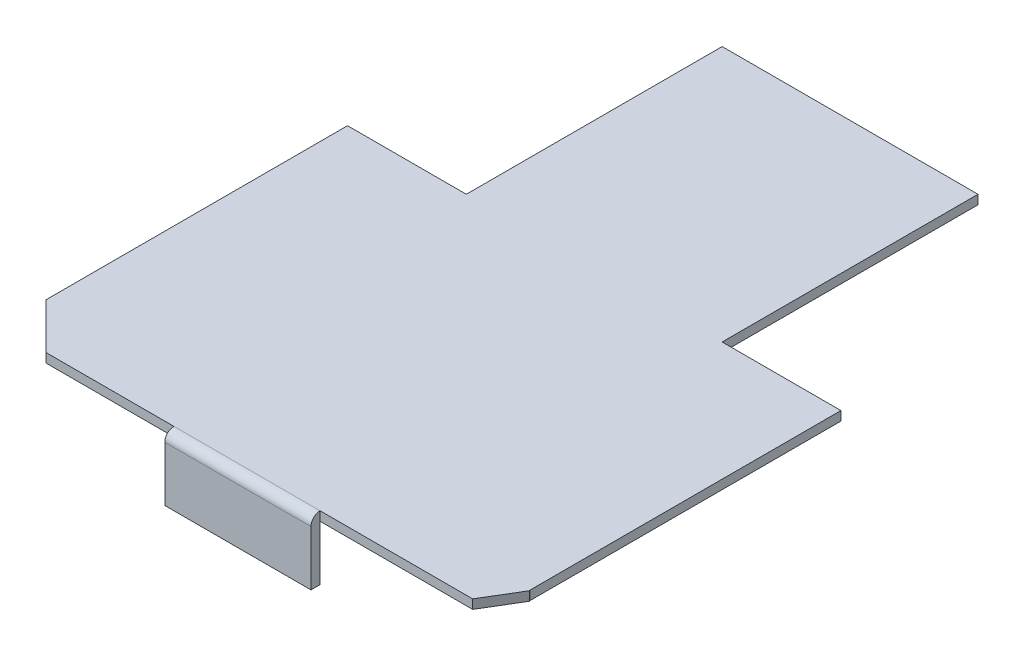
ISO-10303-21;
HEADER;
FILE_DESCRIPTION(('STEP AP214'),'2;1');
FILE_NAME('part.step','',(''),(''),'','','');
FILE_SCHEMA(('AUTOMOTIVE_DESIGN { 1 0 10303 214 1 1 1 1 }'));
ENDSEC;
DATA;
#1=APPLICATION_CONTEXT('core data for automotive mechanical design processes');
#2=APPLICATION_PROTOCOL_DEFINITION('international standard','automotive_design',2000,#1);
#3=PRODUCT_CONTEXT('',#1,'mechanical');
#4=PRODUCT('Part','Part','',(#3));
#5=PRODUCT_RELATED_PRODUCT_CATEGORY('part','',(#4));
#6=PRODUCT_DEFINITION_FORMATION('','',#4);
#7=PRODUCT_DEFINITION_CONTEXT('part definition',#1,'design');
#8=PRODUCT_DEFINITION('design','',#6,#7);
#9=PRODUCT_DEFINITION_SHAPE('','',#8);
#10=(LENGTH_UNIT() NAMED_UNIT(*) SI_UNIT(.MILLI.,.METRE.));
#11=(NAMED_UNIT(*) PLANE_ANGLE_UNIT() SI_UNIT($,.RADIAN.));
#12=(NAMED_UNIT(*) SI_UNIT($,.STERADIAN.) SOLID_ANGLE_UNIT());
#13=UNCERTAINTY_MEASURE_WITH_UNIT(LENGTH_MEASURE(1.E-05),#10,'distance_accuracy_value','');
#14=(GEOMETRIC_REPRESENTATION_CONTEXT(3) GLOBAL_UNCERTAINTY_ASSIGNED_CONTEXT((#13)) GLOBAL_UNIT_ASSIGNED_CONTEXT((#10,
#11,#12)) REPRESENTATION_CONTEXT('',''));
#15=CARTESIAN_POINT('',(0.,0.,0.));
#16=DIRECTION('',(0.,0.,1.));
#17=DIRECTION('',(1.,0.,0.));
#18=AXIS2_PLACEMENT_3D('',#15,#16,#17);
#19=CARTESIAN_POINT('',(-25.4,-19.05,66.675));
#20=DIRECTION('',(1.,0.,0.));
#21=DIRECTION('',(0.,0.,-1.));
#22=AXIS2_PLACEMENT_3D('',#19,#20,#21);
#23=PLANE('',#22);
#24=DIRECTION('',(0.,1.,0.));
#25=VECTOR('',#24,1.);
#26=CARTESIAN_POINT('',(-25.4,-19.05,69.85));
#27=LINE('',#26,#25);
#28=CARTESIAN_POINT('',(-25.4,-19.05,69.85));
#29=VERTEX_POINT('',#28);
#30=CARTESIAN_POINT('',(-25.4,0.,69.8500000000001));
#31=VERTEX_POINT('',#30);
#32=EDGE_CURVE('E268',#29,#31,#27,.T.);
#33=ORIENTED_EDGE('',*,*,#32,.T.);
#34=CARTESIAN_POINT('',(-25.4,0.,66.6750000000001));
#35=DIRECTION('',(1.,0.,0.));
#36=DIRECTION('',(0.,0.,1.));
#37=AXIS2_PLACEMENT_3D('',#34,#35,#36);
#38=CIRCLE('',#37,3.17499999999996);
#39=CARTESIAN_POINT('',(-25.4,3.175,66.675));
#40=VERTEX_POINT('',#39);
#41=EDGE_CURVE('E227',#40,#31,#38,.T.);
#42=ORIENTED_EDGE('',*,*,#41,.F.);
#43=DIRECTION('',(0.,1.,0.));
#44=VECTOR('',#43,1.);
#45=CARTESIAN_POINT('',(-25.4,-19.05,66.675));
#46=LINE('',#45,#44);
#47=CARTESIAN_POINT('',(-25.4,0.,66.675));
#48=VERTEX_POINT('',#47);
#49=EDGE_CURVE('E246',#48,#40,#46,.T.);
#50=ORIENTED_EDGE('',*,*,#49,.F.);
#51=CARTESIAN_POINT('',(-25.4,-19.05,66.675));
#52=VERTEX_POINT('',#51);
#53=EDGE_CURVE('E41',#52,#48,#46,.T.);
#54=ORIENTED_EDGE('',*,*,#53,.F.);
#55=DIRECTION('',(0.,0.,-1.));
#56=VECTOR('',#55,1.);
#57=CARTESIAN_POINT('',(-25.4,-19.05,66.675));
#58=LINE('',#57,#56);
#59=EDGE_CURVE('E260',#29,#52,#58,.T.);
#60=ORIENTED_EDGE('',*,*,#59,.F.);
#61=EDGE_LOOP('',(#33,#42,#50,#54,#60));
#62=FACE_BOUND('',#61,.T.);
#63=ADVANCED_FACE('F33',(#62),#23,.F.);
#64=CARTESIAN_POINT('',(-25.4,-19.05,66.675));
#65=DIRECTION('',(0.,0.,1.));
#66=DIRECTION('',(1.,0.,0.));
#67=AXIS2_PLACEMENT_3D('',#64,#65,#66);
#68=PLANE('',#67);
#69=ORIENTED_EDGE('',*,*,#53,.T.);
#70=DIRECTION('',(1.,0.,0.));
#71=VECTOR('',#70,1.);
#72=CARTESIAN_POINT('',(-82.55,0.,66.675));
#73=LINE('',#72,#71);
#74=CARTESIAN_POINT('',(25.4,0.,66.675));
#75=VERTEX_POINT('',#74);
#76=EDGE_CURVE('E11',#48,#75,#73,.T.);
#77=ORIENTED_EDGE('',*,*,#76,.T.);
#78=DIRECTION('',(0.,1.,0.));
#79=VECTOR('',#78,1.);
#80=CARTESIAN_POINT('',(25.4,-19.05,66.675));
#81=LINE('',#80,#79);
#82=CARTESIAN_POINT('',(25.4,-19.05,66.675));
#83=VERTEX_POINT('',#82);
#84=EDGE_CURVE('E239',#83,#75,#81,.T.);
#85=ORIENTED_EDGE('',*,*,#84,.F.);
#86=DIRECTION('',(1.,0.,0.));
#87=VECTOR('',#86,1.);
#88=CARTESIAN_POINT('',(-25.4,-19.05,66.675));
#89=LINE('',#88,#87);
#90=EDGE_CURVE('E264',#52,#83,#89,.T.);
#91=ORIENTED_EDGE('',*,*,#90,.F.);
#92=EDGE_LOOP('',(#69,#77,#85,#91));
#93=FACE_BOUND('',#92,.T.);
#94=ADVANCED_FACE('F350',(#93),#68,.F.);
#95=CARTESIAN_POINT('',(25.4,-19.05,66.675));
#96=DIRECTION('',(-1.,0.,0.));
#97=DIRECTION('',(0.,0.,1.));
#98=AXIS2_PLACEMENT_3D('',#95,#96,#97);
#99=PLANE('',#98);
#100=ORIENTED_EDGE('',*,*,#84,.T.);
#101=CARTESIAN_POINT('',(25.4,3.175,66.675));
#102=VERTEX_POINT('',#101);
#103=EDGE_CURVE('E236',#75,#102,#81,.T.);
#104=ORIENTED_EDGE('',*,*,#103,.T.);
#105=CARTESIAN_POINT('',(25.4,0.,66.675));
#106=DIRECTION('',(1.,0.,0.));
#107=DIRECTION('',(0.,0.,1.));
#108=AXIS2_PLACEMENT_3D('',#105,#106,#107);
#109=CIRCLE('',#108,3.17499999999996);
#110=CARTESIAN_POINT('',(25.4,0.,69.85));
#111=VERTEX_POINT('',#110);
#112=EDGE_CURVE('E221',#102,#111,#109,.T.);
#113=ORIENTED_EDGE('',*,*,#112,.T.);
#114=DIRECTION('',(0.,1.,0.));
#115=VECTOR('',#114,1.);
#116=CARTESIAN_POINT('',(25.4,-19.05,69.85));
#117=LINE('',#116,#115);
#118=CARTESIAN_POINT('',(25.4,-19.05,69.85));
#119=VERTEX_POINT('',#118);
#120=EDGE_CURVE('E240',#119,#111,#117,.T.);
#121=ORIENTED_EDGE('',*,*,#120,.F.);
#122=DIRECTION('',(0.,0.,1.));
#123=VECTOR('',#122,1.);
#124=CARTESIAN_POINT('',(25.4,-19.05,66.675));
#125=LINE('',#124,#123);
#126=EDGE_CURVE('E272',#83,#119,#125,.T.);
#127=ORIENTED_EDGE('',*,*,#126,.F.);
#128=EDGE_LOOP('',(#100,#104,#113,#121,#127));
#129=FACE_BOUND('',#128,.T.);
#130=ADVANCED_FACE('F363',(#129),#99,.F.);
#131=CARTESIAN_POINT('',(-25.4,-19.05,69.85));
#132=DIRECTION('',(0.,0.,-1.));
#133=DIRECTION('',(-1.,0.,0.));
#134=AXIS2_PLACEMENT_3D('',#131,#132,#133);
#135=PLANE('',#134);
#136=DIRECTION('',(-1.,0.,0.));
#137=VECTOR('',#136,1.);
#138=CARTESIAN_POINT('',(-25.4,0.,69.85));
#139=LINE('',#138,#137);
#140=EDGE_CURVE('E254',#111,#31,#139,.T.);
#141=ORIENTED_EDGE('',*,*,#140,.T.);
#142=ORIENTED_EDGE('',*,*,#32,.F.);
#143=DIRECTION('',(-1.,0.,0.));
#144=VECTOR('',#143,1.);
#145=CARTESIAN_POINT('',(-25.4,-19.05,69.85));
#146=LINE('',#145,#144);
#147=EDGE_CURVE('E58',#119,#29,#146,.T.);
#148=ORIENTED_EDGE('',*,*,#147,.F.);
#149=ORIENTED_EDGE('',*,*,#120,.T.);
#150=EDGE_LOOP('',(#141,#142,#148,#149));
#151=FACE_BOUND('',#150,.T.);
#152=ADVANCED_FACE('F355',(#151),#135,.F.);
#153=CARTESIAN_POINT('',(-25.4,-19.05,69.85));
#154=DIRECTION('',(0.,1.,0.));
#155=DIRECTION('',(0.,0.,1.));
#156=AXIS2_PLACEMENT_3D('',#153,#154,#155);
#157=PLANE('',#156);
#158=ORIENTED_EDGE('',*,*,#59,.T.);
#159=ORIENTED_EDGE('',*,*,#90,.T.);
#160=ORIENTED_EDGE('',*,*,#126,.T.);
#161=ORIENTED_EDGE('',*,*,#147,.T.);
#162=EDGE_LOOP('',(#158,#159,#160,#161));
#163=FACE_BOUND('',#162,.T.);
#164=ADVANCED_FACE('F352',(#163),#157,.F.);
#165=CARTESIAN_POINT('',(-25.4,0.,66.6750000000001));
#166=DIRECTION('',(1.,0.,0.));
#167=DIRECTION('',(0.,0.,-1.));
#168=AXIS2_PLACEMENT_3D('',#165,#166,#167);
#169=CYLINDRICAL_SURFACE('',#168,3.17499999999996);
#170=ORIENTED_EDGE('',*,*,#112,.F.);
#171=DIRECTION('',(1.,0.,0.));
#172=VECTOR('',#171,1.);
#173=CARTESIAN_POINT('',(-25.4,3.175,66.6750000000001));
#174=LINE('',#173,#172);
#175=EDGE_CURVE('E233',#40,#102,#174,.T.);
#176=ORIENTED_EDGE('',*,*,#175,.F.);
#177=ORIENTED_EDGE('',*,*,#41,.T.);
#178=ORIENTED_EDGE('',*,*,#140,.F.);
#179=EDGE_LOOP('',(#170,#176,#177,#178));
#180=FACE_BOUND('',#179,.T.);
#181=ADVANCED_FACE('F354',(#180),#169,.T.);
#182=CARTESIAN_POINT('',(-82.55,0.,66.675));
#183=DIRECTION('',(0.,0.,1.));
#184=DIRECTION('',(1.,0.,0.));
#185=AXIS2_PLACEMENT_3D('',#182,#183,#184);
#186=PLANE('',#185);
#187=ORIENTED_EDGE('',*,*,#103,.F.);
#188=CARTESIAN_POINT('',(78.4273117109311,0.,66.675));
#189=VERTEX_POINT('',#188);
#190=EDGE_CURVE('E44',#75,#189,#73,.T.);
#191=ORIENTED_EDGE('',*,*,#190,.T.);
#192=DIRECTION('',(0.,1.,0.));
#193=VECTOR('',#192,1.);
#194=CARTESIAN_POINT('',(78.4273117109312,0.,66.675));
#195=LINE('',#194,#193);
#196=CARTESIAN_POINT('',(78.4273117109311,3.175,66.675));
#197=VERTEX_POINT('',#196);
#198=EDGE_CURVE('E208',#189,#197,#195,.T.);
#199=ORIENTED_EDGE('',*,*,#198,.T.);
#200=DIRECTION('',(1.,0.,0.));
#201=VECTOR('',#200,1.);
#202=CARTESIAN_POINT('',(-82.55,3.175,66.675));
#203=LINE('',#202,#201);
#204=EDGE_CURVE('E276',#102,#197,#203,.T.);
#205=ORIENTED_EDGE('',*,*,#204,.F.);
#206=EDGE_LOOP('',(#187,#191,#199,#205));
#207=FACE_BOUND('',#206,.T.);
#208=ADVANCED_FACE('F340',(#207),#186,.T.);
#209=CARTESIAN_POINT('',(-85.725,3.175,-53.975));
#210=DIRECTION('',(0.,0.,1.));
#211=DIRECTION('',(1.,0.,0.));
#212=AXIS2_PLACEMENT_3D('',#209,#210,#211);
#213=PLANE('',#212);
#214=DIRECTION('',(0.,1.,0.));
#215=VECTOR('',#214,1.);
#216=CARTESIAN_POINT('',(-44.45,0.,-53.975));
#217=LINE('',#216,#215);
#218=CARTESIAN_POINT('',(-44.45,0.,-53.975));
#219=VERTEX_POINT('',#218);
#220=CARTESIAN_POINT('',(-44.45,3.175,-53.975));
#221=VERTEX_POINT('',#220);
#222=EDGE_CURVE('E152',#219,#221,#217,.T.);
#223=ORIENTED_EDGE('',*,*,#222,.F.);
#224=DIRECTION('',(-1.,0.,0.));
#225=VECTOR('',#224,1.);
#226=CARTESIAN_POINT('',(-85.725,0.,-53.975));
#227=LINE('',#226,#225);
#228=CARTESIAN_POINT('',(-85.725,0.,-53.975));
#229=VERTEX_POINT('',#228);
#230=EDGE_CURVE('E165',#219,#229,#227,.T.);
#231=ORIENTED_EDGE('',*,*,#230,.T.);
#232=DIRECTION('',(0.,-1.,0.));
#233=VECTOR('',#232,1.);
#234=CARTESIAN_POINT('',(-85.725,3.175,-53.975));
#235=LINE('',#234,#233);
#236=CARTESIAN_POINT('',(-85.725,3.175,-53.975));
#237=VERTEX_POINT('',#236);
#238=EDGE_CURVE('E199',#237,#229,#235,.T.);
#239=ORIENTED_EDGE('',*,*,#238,.F.);
#240=DIRECTION('',(-1.,0.,0.));
#241=VECTOR('',#240,1.);
#242=CARTESIAN_POINT('',(-85.725,3.175,-53.975));
#243=LINE('',#242,#241);
#244=EDGE_CURVE('E167',#221,#237,#243,.T.);
#245=ORIENTED_EDGE('',*,*,#244,.F.);
#246=EDGE_LOOP('',(#223,#231,#239,#245));
#247=FACE_BOUND('',#246,.T.);
#248=ADVANCED_FACE('F163',(#247),#213,.F.);
#249=CARTESIAN_POINT('',(85.725,3.175,53.975));
#250=DIRECTION('',(-1.,0.,0.));
#251=DIRECTION('',(0.,0.,1.));
#252=AXIS2_PLACEMENT_3D('',#249,#250,#251);
#253=PLANE('',#252);
#254=DIRECTION('',(0.,0.,-1.));
#255=VECTOR('',#254,1.);
#256=CARTESIAN_POINT('',(85.725,0.,53.975));
#257=LINE('',#256,#255);
#258=CARTESIAN_POINT('',(85.725,0.,53.975));
#259=VERTEX_POINT('',#258);
#260=CARTESIAN_POINT('',(85.725,0.,-53.975));
#261=VERTEX_POINT('',#260);
#262=EDGE_CURVE('E177',#259,#261,#257,.T.);
#263=ORIENTED_EDGE('',*,*,#262,.T.);
#264=DIRECTION('',(0.,-1.,0.));
#265=VECTOR('',#264,1.);
#266=CARTESIAN_POINT('',(85.725,3.175,-53.975));
#267=LINE('',#266,#265);
#268=CARTESIAN_POINT('',(85.725,3.175,-53.975));
#269=VERTEX_POINT('',#268);
#270=EDGE_CURVE('E202',#269,#261,#267,.T.);
#271=ORIENTED_EDGE('',*,*,#270,.F.);
#272=DIRECTION('',(0.,0.,-1.));
#273=VECTOR('',#272,1.);
#274=CARTESIAN_POINT('',(85.725,3.175,53.975));
#275=LINE('',#274,#273);
#276=CARTESIAN_POINT('',(85.725,3.175,53.975));
#277=VERTEX_POINT('',#276);
#278=EDGE_CURVE('E195',#277,#269,#275,.T.);
#279=ORIENTED_EDGE('',*,*,#278,.F.);
#280=DIRECTION('',(0.,-1.,0.));
#281=VECTOR('',#280,1.);
#282=CARTESIAN_POINT('',(85.725,3.175,53.975));
#283=LINE('',#282,#281);
#284=EDGE_CURVE('E196',#277,#259,#283,.T.);
#285=ORIENTED_EDGE('',*,*,#284,.T.);
#286=EDGE_LOOP('',(#263,#271,#279,#285));
#287=FACE_BOUND('',#286,.T.);
#288=ADVANCED_FACE('F330',(#287),#253,.F.);
#289=CARTESIAN_POINT('',(44.45,0.,-53.975));
#290=VERTEX_POINT('',#289);
#291=EDGE_CURVE('E176',#261,#290,#227,.T.);
#292=ORIENTED_EDGE('',*,*,#291,.T.);
#293=DIRECTION('',(0.,1.,0.));
#294=VECTOR('',#293,1.);
#295=CARTESIAN_POINT('',(44.45,0.,-53.975));
#296=LINE('',#295,#294);
#297=CARTESIAN_POINT('',(44.45,3.175,-53.975));
#298=VERTEX_POINT('',#297);
#299=EDGE_CURVE('E168',#290,#298,#296,.T.);
#300=ORIENTED_EDGE('',*,*,#299,.T.);
#301=EDGE_CURVE('E187',#269,#298,#243,.T.);
#302=ORIENTED_EDGE('',*,*,#301,.F.);
#303=ORIENTED_EDGE('',*,*,#270,.T.);
#304=EDGE_LOOP('',(#292,#300,#302,#303));
#305=FACE_BOUND('',#304,.T.);
#306=ADVANCED_FACE('F326',(#305),#213,.F.);
#307=CARTESIAN_POINT('',(-85.725,3.175,53.975));
#308=DIRECTION('',(1.,0.,0.));
#309=DIRECTION('',(0.,0.,-1.));
#310=AXIS2_PLACEMENT_3D('',#307,#308,#309);
#311=PLANE('',#310);
#312=DIRECTION('',(0.,0.,1.));
#313=VECTOR('',#312,1.);
#314=CARTESIAN_POINT('',(-85.725,0.,53.975));
#315=LINE('',#314,#313);
#316=CARTESIAN_POINT('',(-85.725,0.,50.7999999999998));
#317=VERTEX_POINT('',#316);
#318=EDGE_CURVE('E175',#229,#317,#315,.T.);
#319=ORIENTED_EDGE('',*,*,#318,.T.);
#320=DIRECTION('',(0.,-1.,0.));
#321=VECTOR('',#320,1.);
#322=CARTESIAN_POINT('',(-85.725,0.,50.7999999999997));
#323=LINE('',#322,#321);
#324=CARTESIAN_POINT('',(-85.725,3.175,50.7999999999998));
#325=VERTEX_POINT('',#324);
#326=EDGE_CURVE('E220',#317,#325,#323,.F.);
#327=ORIENTED_EDGE('',*,*,#326,.T.);
#328=DIRECTION('',(0.,0.,1.));
#329=VECTOR('',#328,1.);
#330=CARTESIAN_POINT('',(-85.725,3.175,53.975));
#331=LINE('',#330,#329);
#332=EDGE_CURVE('E200',#237,#325,#331,.T.);
#333=ORIENTED_EDGE('',*,*,#332,.F.);
#334=ORIENTED_EDGE('',*,*,#238,.T.);
#335=EDGE_LOOP('',(#319,#327,#333,#334));
#336=FACE_BOUND('',#335,.T.);
#337=ADVANCED_FACE('F420',(#336),#311,.F.);
#338=CARTESIAN_POINT('',(85.725,3.175,-53.975));
#339=DIRECTION('',(0.,-1.,0.));
#340=DIRECTION('',(0.,0.,-1.));
#341=AXIS2_PLACEMENT_3D('',#338,#339,#340);
#342=PLANE('',#341);
#343=CARTESIAN_POINT('',(-69.8499999999999,3.175,66.675));
#344=VERTEX_POINT('',#343);
#345=EDGE_CURVE('E279',#344,#40,#203,.T.);
#346=ORIENTED_EDGE('',*,*,#345,.T.);
#347=ORIENTED_EDGE('',*,*,#175,.T.);
#348=ORIENTED_EDGE('',*,*,#204,.T.);
#349=DIRECTION('',(-0.514495755427524,0.,0.857492925712546));
#350=VECTOR('',#349,1.);
#351=CARTESIAN_POINT('',(78.4273117109312,3.175,66.675));
#352=LINE('',#351,#350);
#353=CARTESIAN_POINT('',(85.8197975620386,3.175,54.3541902481542));
#354=VERTEX_POINT('',#353);
#355=EDGE_CURVE('E213',#197,#354,#352,.F.);
#356=ORIENTED_EDGE('',*,*,#355,.T.);
#357=DIRECTION('',(-0.242535625036332,0.,-0.970142500145332));
#358=VECTOR('',#357,1.);
#359=CARTESIAN_POINT('',(88.9,3.175,66.675));
#360=LINE('',#359,#358);
#361=EDGE_CURVE('E284',#354,#277,#360,.T.);
#362=ORIENTED_EDGE('',*,*,#361,.T.);
#363=ORIENTED_EDGE('',*,*,#278,.T.);
#364=ORIENTED_EDGE('',*,*,#301,.T.);
#365=DIRECTION('',(0.,0.,-1.));
#366=VECTOR('',#365,1.);
#367=CARTESIAN_POINT('',(44.45,3.175,-53.975));
#368=LINE('',#367,#366);
#369=CARTESIAN_POINT('',(44.45,3.175,-142.875));
#370=VERTEX_POINT('',#369);
#371=EDGE_CURVE('E291',#298,#370,#368,.T.);
#372=ORIENTED_EDGE('',*,*,#371,.T.);
#373=DIRECTION('',(-1.,0.,0.));
#374=VECTOR('',#373,1.);
#375=CARTESIAN_POINT('',(-44.45,3.175,-142.875));
#376=LINE('',#375,#374);
#377=CARTESIAN_POINT('',(-44.45,3.175,-142.875));
#378=VERTEX_POINT('',#377);
#379=EDGE_CURVE('E159',#370,#378,#376,.T.);
#380=ORIENTED_EDGE('',*,*,#379,.T.);
#381=DIRECTION('',(0.,0.,1.));
#382=VECTOR('',#381,1.);
#383=CARTESIAN_POINT('',(-44.45,3.175,-53.975));
#384=LINE('',#383,#382);
#385=EDGE_CURVE('E294',#378,#221,#384,.T.);
#386=ORIENTED_EDGE('',*,*,#385,.T.);
#387=ORIENTED_EDGE('',*,*,#244,.T.);
#388=ORIENTED_EDGE('',*,*,#332,.T.);
#389=DIRECTION('',(-0.707106781186544,0.,-0.707106781186551));
#390=VECTOR('',#389,1.);
#391=CARTESIAN_POINT('',(-86.7833333333334,3.175,49.7416666666663));
#392=LINE('',#391,#390);
#393=EDGE_CURVE('E211',#325,#344,#392,.F.);
#394=ORIENTED_EDGE('',*,*,#393,.T.);
#395=EDGE_LOOP('',(#346,#347,#348,#356,#362,#363,#364,#372,#380,#386,#387,#388,#394));
#396=FACE_BOUND('',#395,.T.);
#397=ADVANCED_FACE('F313',(#396),#342,.F.);
#398=CARTESIAN_POINT('',(85.725,0.,-53.975));
#399=DIRECTION('',(0.,-1.,0.));
#400=DIRECTION('',(0.,0.,-1.));
#401=AXIS2_PLACEMENT_3D('',#398,#399,#400);
#402=PLANE('',#401);
#403=DIRECTION('',(-0.242535625036332,0.,-0.970142500145332));
#404=VECTOR('',#403,1.);
#405=CARTESIAN_POINT('',(88.9,0.,66.675));
#406=LINE('',#405,#404);
#407=CARTESIAN_POINT('',(85.8197975620386,0.,54.3541902481543));
#408=VERTEX_POINT('',#407);
#409=EDGE_CURVE('E182',#408,#259,#406,.T.);
#410=ORIENTED_EDGE('',*,*,#409,.F.);
#411=DIRECTION('',(0.514495755427524,0.,-0.857492925712546));
#412=VECTOR('',#411,1.);
#413=CARTESIAN_POINT('',(133.586993905096,0.,-25.2578036569424));
#414=LINE('',#413,#412);
#415=EDGE_CURVE('E219',#408,#189,#414,.F.);
#416=ORIENTED_EDGE('',*,*,#415,.T.);
#417=ORIENTED_EDGE('',*,*,#190,.F.);
#418=ORIENTED_EDGE('',*,*,#76,.F.);
#419=CARTESIAN_POINT('',(-69.8499999999999,0.,66.675));
#420=VERTEX_POINT('',#419);
#421=EDGE_CURVE('E43',#420,#48,#73,.T.);
#422=ORIENTED_EDGE('',*,*,#421,.F.);
#423=DIRECTION('',(0.707106781186544,0.,0.707106781186551));
#424=VECTOR('',#423,1.);
#425=CARTESIAN_POINT('',(-52.3875000000007,0.,84.1374999999994));
#426=LINE('',#425,#424);
#427=EDGE_CURVE('E217',#420,#317,#426,.F.);
#428=ORIENTED_EDGE('',*,*,#427,.T.);
#429=ORIENTED_EDGE('',*,*,#318,.F.);
#430=ORIENTED_EDGE('',*,*,#230,.F.);
#431=DIRECTION('',(0.,0.,1.));
#432=VECTOR('',#431,1.);
#433=CARTESIAN_POINT('',(-44.45,0.,-53.975));
#434=LINE('',#433,#432);
#435=CARTESIAN_POINT('',(-44.45,0.,-142.875));
#436=VERTEX_POINT('',#435);
#437=EDGE_CURVE('E148',#436,#219,#434,.T.);
#438=ORIENTED_EDGE('',*,*,#437,.F.);
#439=DIRECTION('',(-1.,0.,0.));
#440=VECTOR('',#439,1.);
#441=CARTESIAN_POINT('',(-44.45,0.,-142.875));
#442=LINE('',#441,#440);
#443=CARTESIAN_POINT('',(44.45,0.,-142.875));
#444=VERTEX_POINT('',#443);
#445=EDGE_CURVE('E169',#444,#436,#442,.T.);
#446=ORIENTED_EDGE('',*,*,#445,.F.);
#447=DIRECTION('',(0.,0.,-1.));
#448=VECTOR('',#447,1.);
#449=CARTESIAN_POINT('',(44.45,0.,-53.975));
#450=LINE('',#449,#448);
#451=EDGE_CURVE('E158',#290,#444,#450,.T.);
#452=ORIENTED_EDGE('',*,*,#451,.F.);
#453=ORIENTED_EDGE('',*,*,#291,.F.);
#454=ORIENTED_EDGE('',*,*,#262,.F.);
#455=EDGE_LOOP('',(#410,#416,#417,#418,#422,#428,#429,#430,#438,#446,#452,#453,#454));
#456=FACE_BOUND('',#455,.T.);
#457=ADVANCED_FACE('F173',(#456),#402,.T.);
#458=CARTESIAN_POINT('',(88.9,0.,66.675));
#459=DIRECTION('',(0.970142500145332,0.,-0.242535625036332));
#460=DIRECTION('',(-0.242535625036332,0.,-0.970142500145332));
#461=AXIS2_PLACEMENT_3D('',#458,#459,#460);
#462=PLANE('',#461);
#463=ORIENTED_EDGE('',*,*,#361,.F.);
#464=DIRECTION('',(0.,-1.,0.));
#465=VECTOR('',#464,1.);
#466=CARTESIAN_POINT('',(85.8197975620386,0.,54.3541902481542));
#467=LINE('',#466,#465);
#468=EDGE_CURVE('E215',#354,#408,#467,.T.);
#469=ORIENTED_EDGE('',*,*,#468,.T.);
#470=ORIENTED_EDGE('',*,*,#409,.T.);
#471=ORIENTED_EDGE('',*,*,#284,.F.);
#472=EDGE_LOOP('',(#463,#469,#470,#471));
#473=FACE_BOUND('',#472,.T.);
#474=ADVANCED_FACE('F445',(#473),#462,.T.);
#475=ORIENTED_EDGE('',*,*,#421,.T.);
#476=ORIENTED_EDGE('',*,*,#49,.T.);
#477=ORIENTED_EDGE('',*,*,#345,.F.);
#478=DIRECTION('',(0.,-1.,0.));
#479=VECTOR('',#478,1.);
#480=CARTESIAN_POINT('',(-69.8499999999999,0.,66.675));
#481=LINE('',#480,#479);
#482=EDGE_CURVE('E205',#344,#420,#481,.T.);
#483=ORIENTED_EDGE('',*,*,#482,.T.);
#484=EDGE_LOOP('',(#475,#476,#477,#483));
#485=FACE_BOUND('',#484,.T.);
#486=ADVANCED_FACE('F345',(#485),#186,.T.);
#487=CARTESIAN_POINT('',(78.4273117109312,0.,66.675));
#488=DIRECTION('',(-0.857492925712546,0.,-0.514495755427524));
#489=DIRECTION('',(-0.514495755427524,0.,0.857492925712546));
#490=AXIS2_PLACEMENT_3D('',#487,#488,#489);
#491=PLANE('',#490);
#492=ORIENTED_EDGE('',*,*,#415,.F.);
#493=ORIENTED_EDGE('',*,*,#468,.F.);
#494=ORIENTED_EDGE('',*,*,#355,.F.);
#495=ORIENTED_EDGE('',*,*,#198,.F.);
#496=EDGE_LOOP('',(#492,#493,#494,#495));
#497=FACE_BOUND('',#496,.T.);
#498=ADVANCED_FACE('F337',(#497),#491,.F.);
#499=CARTESIAN_POINT('',(-86.7833333333334,0.,49.7416666666663));
#500=DIRECTION('',(0.707106781186551,0.,-0.707106781186544));
#501=DIRECTION('',(-0.707106781186544,0.,-0.707106781186551));
#502=AXIS2_PLACEMENT_3D('',#499,#500,#501);
#503=PLANE('',#502);
#504=ORIENTED_EDGE('',*,*,#427,.F.);
#505=ORIENTED_EDGE('',*,*,#482,.F.);
#506=ORIENTED_EDGE('',*,*,#393,.F.);
#507=ORIENTED_EDGE('',*,*,#326,.F.);
#508=EDGE_LOOP('',(#504,#505,#506,#507));
#509=FACE_BOUND('',#508,.T.);
#510=ADVANCED_FACE('F472',(#509),#503,.F.);
#511=CARTESIAN_POINT('',(-44.45,0.,-53.975));
#512=DIRECTION('',(-1.,0.,0.));
#513=DIRECTION('',(0.,0.,1.));
#514=AXIS2_PLACEMENT_3D('',#511,#512,#513);
#515=PLANE('',#514);
#516=ORIENTED_EDGE('',*,*,#385,.F.);
#517=DIRECTION('',(0.,1.,0.));
#518=VECTOR('',#517,1.);
#519=CARTESIAN_POINT('',(-44.45,0.,-142.875));
#520=LINE('',#519,#518);
#521=EDGE_CURVE('E154',#436,#378,#520,.T.);
#522=ORIENTED_EDGE('',*,*,#521,.F.);
#523=ORIENTED_EDGE('',*,*,#437,.T.);
#524=ORIENTED_EDGE('',*,*,#222,.T.);
#525=EDGE_LOOP('',(#516,#522,#523,#524));
#526=FACE_BOUND('',#525,.T.);
#527=ADVANCED_FACE('F151',(#526),#515,.T.);
#528=CARTESIAN_POINT('',(-44.45,0.,-142.875));
#529=DIRECTION('',(0.,0.,-1.));
#530=DIRECTION('',(-1.,0.,0.));
#531=AXIS2_PLACEMENT_3D('',#528,#529,#530);
#532=PLANE('',#531);
#533=ORIENTED_EDGE('',*,*,#379,.F.);
#534=DIRECTION('',(0.,1.,0.));
#535=VECTOR('',#534,1.);
#536=CARTESIAN_POINT('',(44.45,0.,-142.875));
#537=LINE('',#536,#535);
#538=EDGE_CURVE('E300',#444,#370,#537,.T.);
#539=ORIENTED_EDGE('',*,*,#538,.F.);
#540=ORIENTED_EDGE('',*,*,#445,.T.);
#541=ORIENTED_EDGE('',*,*,#521,.T.);
#542=EDGE_LOOP('',(#533,#539,#540,#541));
#543=FACE_BOUND('',#542,.T.);
#544=ADVANCED_FACE('F323',(#543),#532,.T.);
#545=CARTESIAN_POINT('',(44.45,0.,-53.975));
#546=DIRECTION('',(1.,0.,0.));
#547=DIRECTION('',(0.,0.,-1.));
#548=AXIS2_PLACEMENT_3D('',#545,#546,#547);
#549=PLANE('',#548);
#550=ORIENTED_EDGE('',*,*,#371,.F.);
#551=ORIENTED_EDGE('',*,*,#299,.F.);
#552=ORIENTED_EDGE('',*,*,#451,.T.);
#553=ORIENTED_EDGE('',*,*,#538,.T.);
#554=EDGE_LOOP('',(#550,#551,#552,#553));
#555=FACE_BOUND('',#554,.T.);
#556=ADVANCED_FACE('F321',(#555),#549,.T.);
#557=CLOSED_SHELL('',(#63,#94,#130,#152,#164,#181,#208,#248,#288,#306,#337,#397,#457,#474,#486,
#498,#510,#527,#544,#556));
#558=MANIFOLD_SOLID_BREP('B2',#557);
#559=ADVANCED_BREP_SHAPE_REPRESENTATION('',(#18,#558),#14);
#560=SHAPE_DEFINITION_REPRESENTATION(#9,#559);
ENDSEC;
END-ISO-10303-21;
